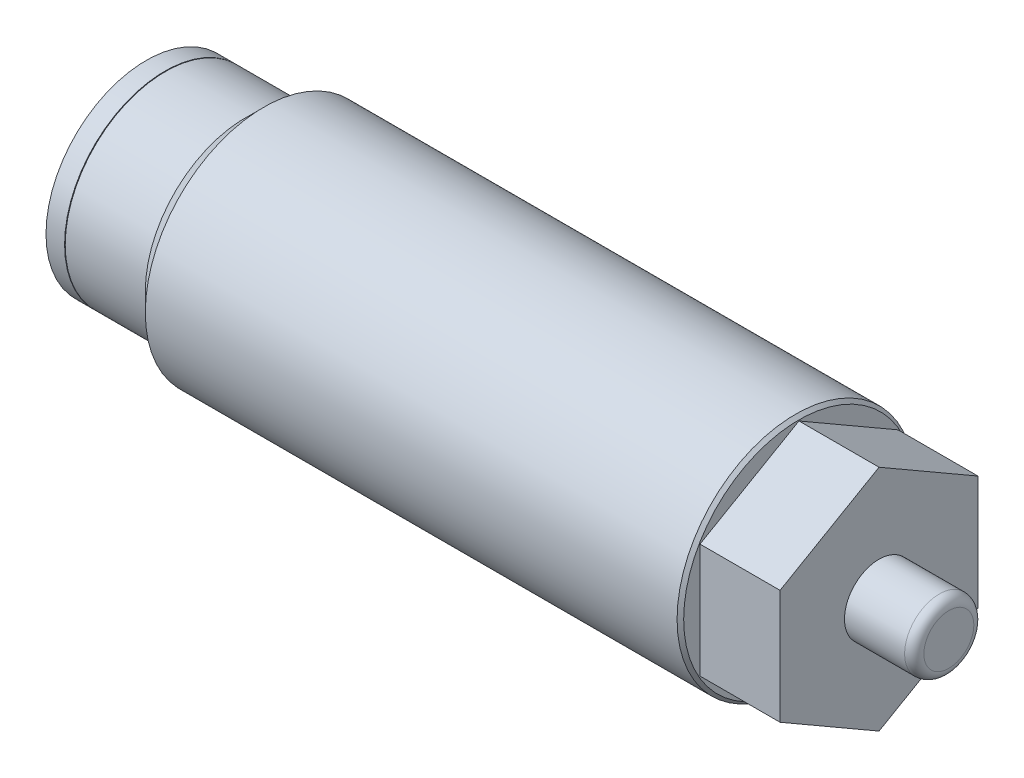
ISO-10303-21;
HEADER;
FILE_DESCRIPTION(('STEP AP214'),'2;1');
FILE_NAME('part.step','',(''),(''),'','','');
FILE_SCHEMA(('AUTOMOTIVE_DESIGN { 1 0 10303 214 1 1 1 1 }'));
ENDSEC;
DATA;
#1=APPLICATION_CONTEXT('core data for automotive mechanical design processes');
#2=APPLICATION_PROTOCOL_DEFINITION('international standard','automotive_design',2000,#1);
#3=PRODUCT_CONTEXT('',#1,'mechanical');
#4=PRODUCT('Part','Part','',(#3));
#5=PRODUCT_RELATED_PRODUCT_CATEGORY('part','',(#4));
#6=PRODUCT_DEFINITION_FORMATION('','',#4);
#7=PRODUCT_DEFINITION_CONTEXT('part definition',#1,'design');
#8=PRODUCT_DEFINITION('design','',#6,#7);
#9=PRODUCT_DEFINITION_SHAPE('','',#8);
#10=(LENGTH_UNIT() NAMED_UNIT(*) SI_UNIT(.MILLI.,.METRE.));
#11=(NAMED_UNIT(*) PLANE_ANGLE_UNIT() SI_UNIT($,.RADIAN.));
#12=(NAMED_UNIT(*) SI_UNIT($,.STERADIAN.) SOLID_ANGLE_UNIT());
#13=UNCERTAINTY_MEASURE_WITH_UNIT(LENGTH_MEASURE(1.E-05),#10,'distance_accuracy_value','');
#14=(GEOMETRIC_REPRESENTATION_CONTEXT(3) GLOBAL_UNCERTAINTY_ASSIGNED_CONTEXT((#13)) GLOBAL_UNIT_ASSIGNED_CONTEXT((#10,
#11,#12)) REPRESENTATION_CONTEXT('',''));
#15=CARTESIAN_POINT('',(0.,0.,0.));
#16=DIRECTION('',(0.,0.,1.));
#17=DIRECTION('',(1.,0.,0.));
#18=AXIS2_PLACEMENT_3D('',#15,#16,#17);
#19=CARTESIAN_POINT('',(28.2956,0.,0.));
#20=DIRECTION('',(1.,0.,0.));
#21=DIRECTION('',(0.,0.,-1.));
#22=AXIS2_PLACEMENT_3D('',#19,#20,#21);
#23=CYLINDRICAL_SURFACE('',#22,1.3716);
#24=CARTESIAN_POINT('',(30.6832,0.,0.));
#25=DIRECTION('',(1.,0.,0.));
#26=DIRECTION('',(0.,0.,-1.));
#27=AXIS2_PLACEMENT_3D('',#24,#25,#26);
#28=CIRCLE('',#27,1.3716);
#29=CARTESIAN_POINT('',(30.6832,0.,-1.3716));
#30=VERTEX_POINT('',#29);
#31=EDGE_CURVE('E11',#30,#30,#28,.F.);
#32=ORIENTED_EDGE('',*,*,#31,.T.);
#33=EDGE_LOOP('',(#32));
#34=FACE_BOUND('',#33,.T.);
#35=CARTESIAN_POINT('',(28.2956,0.,0.));
#36=DIRECTION('',(1.,0.,0.));
#37=DIRECTION('',(0.,0.,-1.));
#38=AXIS2_PLACEMENT_3D('',#35,#36,#37);
#39=CIRCLE('',#38,1.3716);
#40=CARTESIAN_POINT('',(28.2956,0.,-1.3716));
#41=VERTEX_POINT('',#40);
#42=EDGE_CURVE('E52',#41,#41,#39,.T.);
#43=ORIENTED_EDGE('',*,*,#42,.T.);
#44=EDGE_LOOP('',(#43));
#45=FACE_BOUND('',#44,.T.);
#46=ADVANCED_FACE('F41',(#34,#45),#23,.T.);
#47=CARTESIAN_POINT('',(28.2956,1.3716,0.));
#48=DIRECTION('',(-1.,0.,0.));
#49=DIRECTION('',(0.,0.,1.));
#50=AXIS2_PLACEMENT_3D('',#47,#48,#49);
#51=PLANE('',#50);
#52=ORIENTED_EDGE('',*,*,#42,.F.);
#53=EDGE_LOOP('',(#52));
#54=FACE_BOUND('',#53,.T.);
#55=ADVANCED_FACE('F60',(#54),#51,.T.);
#56=CARTESIAN_POINT('',(31.0642,0.,0.));
#57=DIRECTION('',(1.,0.,0.));
#58=DIRECTION('',(0.,0.,-1.));
#59=AXIS2_PLACEMENT_3D('',#56,#57,#58);
#60=PLANE('',#59);
#61=CARTESIAN_POINT('',(31.0642,0.,0.));
#62=DIRECTION('',(1.,0.,0.));
#63=DIRECTION('',(0.,0.,-1.));
#64=AXIS2_PLACEMENT_3D('',#61,#62,#63);
#65=CIRCLE('',#64,0.990599999999999);
#66=CARTESIAN_POINT('',(31.0642,0.,-0.990599999999999));
#67=VERTEX_POINT('',#66);
#68=EDGE_CURVE('E48',#67,#67,#65,.T.);
#69=ORIENTED_EDGE('',*,*,#68,.T.);
#70=EDGE_LOOP('',(#69));
#71=FACE_BOUND('',#70,.T.);
#72=ADVANCED_FACE('F62',(#71),#60,.T.);
#73=CARTESIAN_POINT('',(30.6832,0.,0.));
#74=DIRECTION('',(1.,0.,0.));
#75=DIRECTION('',(0.,0.,-1.));
#76=AXIS2_PLACEMENT_3D('',#73,#74,#75);
#77=TOROIDAL_SURFACE('',#76,0.990599999999999,0.381);
#78=ORIENTED_EDGE('',*,*,#31,.F.);
#79=EDGE_LOOP('',(#78));
#80=FACE_BOUND('',#79,.T.);
#81=ORIENTED_EDGE('',*,*,#68,.F.);
#82=EDGE_LOOP('',(#81));
#83=FACE_BOUND('',#82,.T.);
#84=ADVANCED_FACE('F43',(#80,#83),#77,.T.);
#85=CLOSED_SHELL('',(#46,#55,#72,#84));
#86=MANIFOLD_SOLID_BREP('B2',#85);
#87=CARTESIAN_POINT('',(28.2956,-2.26569566138085,-3.9243));
#88=DIRECTION('',(0.,0.,1.));
#89=DIRECTION('',(1.,0.,0.));
#90=AXIS2_PLACEMENT_3D('',#87,#88,#89);
#91=PLANE('',#90);
#92=DIRECTION('',(0.,1.,0.));
#93=VECTOR('',#92,1.);
#94=CARTESIAN_POINT('',(25.1206,-2.26569566138085,-3.9243));
#95=LINE('',#94,#93);
#96=CARTESIAN_POINT('',(25.1206,-2.26569566138085,-3.9243));
#97=VERTEX_POINT('',#96);
#98=CARTESIAN_POINT('',(25.1206,2.26569566138085,-3.9243));
#99=VERTEX_POINT('',#98);
#100=EDGE_CURVE('E188',#97,#99,#95,.T.);
#101=ORIENTED_EDGE('',*,*,#100,.T.);
#102=DIRECTION('',(-1.,0.,0.));
#103=VECTOR('',#102,1.);
#104=CARTESIAN_POINT('',(28.2956,2.26569566138085,-3.9243));
#105=LINE('',#104,#103);
#106=CARTESIAN_POINT('',(28.2956,2.26569566138085,-3.9243));
#107=VERTEX_POINT('',#106);
#108=EDGE_CURVE('E39',#107,#99,#105,.T.);
#109=ORIENTED_EDGE('',*,*,#108,.F.);
#110=DIRECTION('',(0.,1.,0.));
#111=VECTOR('',#110,1.);
#112=CARTESIAN_POINT('',(28.2956,-2.26569566138085,-3.9243));
#113=LINE('',#112,#111);
#114=CARTESIAN_POINT('',(28.2956,-2.26569566138085,-3.9243));
#115=VERTEX_POINT('',#114);
#116=EDGE_CURVE('E198',#115,#107,#113,.T.);
#117=ORIENTED_EDGE('',*,*,#116,.F.);
#118=DIRECTION('',(-1.,0.,0.));
#119=VECTOR('',#118,1.);
#120=CARTESIAN_POINT('',(28.2956,-2.26569566138085,-3.9243));
#121=LINE('',#120,#119);
#122=EDGE_CURVE('E184',#115,#97,#121,.T.);
#123=ORIENTED_EDGE('',*,*,#122,.T.);
#124=EDGE_LOOP('',(#101,#109,#117,#123));
#125=FACE_BOUND('',#124,.T.);
#126=ADVANCED_FACE('F104',(#125),#91,.F.);
#127=CARTESIAN_POINT('',(28.2956,2.26569566138085,-3.9243));
#128=DIRECTION('',(0.,-0.866025403784439,0.5));
#129=DIRECTION('',(0.,-0.5,-0.866025403784438));
#130=AXIS2_PLACEMENT_3D('',#127,#128,#129);
#131=PLANE('',#130);
#132=DIRECTION('',(0.,0.5,0.866025403784439));
#133=VECTOR('',#132,1.);
#134=CARTESIAN_POINT('',(25.1206,2.26569566138085,-3.9243));
#135=LINE('',#134,#133);
#136=CARTESIAN_POINT('',(25.1206,4.53139132276169,0.));
#137=VERTEX_POINT('',#136);
#138=EDGE_CURVE('E191',#99,#137,#135,.T.);
#139=ORIENTED_EDGE('',*,*,#138,.T.);
#140=DIRECTION('',(-1.,0.,0.));
#141=VECTOR('',#140,1.);
#142=CARTESIAN_POINT('',(28.2956,4.53139132276169,0.));
#143=LINE('',#142,#141);
#144=CARTESIAN_POINT('',(28.2956,4.53139132276169,0.));
#145=VERTEX_POINT('',#144);
#146=EDGE_CURVE('E112',#145,#137,#143,.T.);
#147=ORIENTED_EDGE('',*,*,#146,.F.);
#148=DIRECTION('',(0.,0.5,0.866025403784439));
#149=VECTOR('',#148,1.);
#150=CARTESIAN_POINT('',(28.2956,2.26569566138085,-3.9243));
#151=LINE('',#150,#149);
#152=EDGE_CURVE('E157',#107,#145,#151,.T.);
#153=ORIENTED_EDGE('',*,*,#152,.F.);
#154=ORIENTED_EDGE('',*,*,#108,.T.);
#155=EDGE_LOOP('',(#139,#147,#153,#154));
#156=FACE_BOUND('',#155,.T.);
#157=ADVANCED_FACE('F222',(#156),#131,.F.);
#158=CARTESIAN_POINT('',(28.2956,4.53139132276169,0.));
#159=DIRECTION('',(0.,-0.866025403784439,-0.5));
#160=DIRECTION('',(0.,0.5,-0.866025403784439));
#161=AXIS2_PLACEMENT_3D('',#158,#159,#160);
#162=PLANE('',#161);
#163=DIRECTION('',(0.,-0.5,0.866025403784439));
#164=VECTOR('',#163,1.);
#165=CARTESIAN_POINT('',(25.1206,4.53139132276169,0.));
#166=LINE('',#165,#164);
#167=CARTESIAN_POINT('',(25.1206,2.26569566138085,3.9243));
#168=VERTEX_POINT('',#167);
#169=EDGE_CURVE('E193',#137,#168,#166,.T.);
#170=ORIENTED_EDGE('',*,*,#169,.T.);
#171=DIRECTION('',(-1.,0.,0.));
#172=VECTOR('',#171,1.);
#173=CARTESIAN_POINT('',(28.2956,2.26569566138085,3.9243));
#174=LINE('',#173,#172);
#175=CARTESIAN_POINT('',(28.2956,2.26569566138085,3.9243));
#176=VERTEX_POINT('',#175);
#177=EDGE_CURVE('E179',#176,#168,#174,.T.);
#178=ORIENTED_EDGE('',*,*,#177,.F.);
#179=DIRECTION('',(0.,-0.5,0.866025403784439));
#180=VECTOR('',#179,1.);
#181=CARTESIAN_POINT('',(28.2956,4.53139132276169,0.));
#182=LINE('',#181,#180);
#183=EDGE_CURVE('E170',#145,#176,#182,.T.);
#184=ORIENTED_EDGE('',*,*,#183,.F.);
#185=ORIENTED_EDGE('',*,*,#146,.T.);
#186=EDGE_LOOP('',(#170,#178,#184,#185));
#187=FACE_BOUND('',#186,.T.);
#188=ADVANCED_FACE('F204',(#187),#162,.F.);
#189=CARTESIAN_POINT('',(28.2956,2.26569566138085,3.9243));
#190=DIRECTION('',(0.,0.,-1.));
#191=DIRECTION('',(-1.,0.,0.));
#192=AXIS2_PLACEMENT_3D('',#189,#190,#191);
#193=PLANE('',#192);
#194=DIRECTION('',(0.,-1.,0.));
#195=VECTOR('',#194,1.);
#196=CARTESIAN_POINT('',(25.1206,2.26569566138085,3.9243));
#197=LINE('',#196,#195);
#198=CARTESIAN_POINT('',(25.1206,-2.26569566138085,3.9243));
#199=VERTEX_POINT('',#198);
#200=EDGE_CURVE('E178',#168,#199,#197,.T.);
#201=ORIENTED_EDGE('',*,*,#200,.T.);
#202=DIRECTION('',(-1.,0.,0.));
#203=VECTOR('',#202,1.);
#204=CARTESIAN_POINT('',(28.2956,-2.26569566138085,3.9243));
#205=LINE('',#204,#203);
#206=CARTESIAN_POINT('',(28.2956,-2.26569566138085,3.9243));
#207=VERTEX_POINT('',#206);
#208=EDGE_CURVE('E175',#207,#199,#205,.T.);
#209=ORIENTED_EDGE('',*,*,#208,.F.);
#210=DIRECTION('',(0.,-1.,0.));
#211=VECTOR('',#210,1.);
#212=CARTESIAN_POINT('',(28.2956,2.26569566138085,3.9243));
#213=LINE('',#212,#211);
#214=EDGE_CURVE('E164',#176,#207,#213,.T.);
#215=ORIENTED_EDGE('',*,*,#214,.F.);
#216=ORIENTED_EDGE('',*,*,#177,.T.);
#217=EDGE_LOOP('',(#201,#209,#215,#216));
#218=FACE_BOUND('',#217,.T.);
#219=ADVANCED_FACE('F176',(#218),#193,.F.);
#220=CARTESIAN_POINT('',(28.2956,-2.26569566138085,3.9243));
#221=DIRECTION('',(0.,0.866025403784439,-0.5));
#222=DIRECTION('',(0.,0.5,0.866025403784439));
#223=AXIS2_PLACEMENT_3D('',#220,#221,#222);
#224=PLANE('',#223);
#225=DIRECTION('',(0.,-0.5,-0.866025403784439));
#226=VECTOR('',#225,1.);
#227=CARTESIAN_POINT('',(25.1206,-2.26569566138085,3.9243));
#228=LINE('',#227,#226);
#229=CARTESIAN_POINT('',(25.1206,-4.5313913227617,0.));
#230=VERTEX_POINT('',#229);
#231=EDGE_CURVE('E143',#199,#230,#228,.T.);
#232=ORIENTED_EDGE('',*,*,#231,.T.);
#233=DIRECTION('',(-1.,0.,0.));
#234=VECTOR('',#233,1.);
#235=CARTESIAN_POINT('',(28.2956,-4.5313913227617,0.));
#236=LINE('',#235,#234);
#237=CARTESIAN_POINT('',(28.2956,-4.5313913227617,0.));
#238=VERTEX_POINT('',#237);
#239=EDGE_CURVE('E180',#238,#230,#236,.T.);
#240=ORIENTED_EDGE('',*,*,#239,.F.);
#241=DIRECTION('',(0.,-0.5,-0.866025403784439));
#242=VECTOR('',#241,1.);
#243=CARTESIAN_POINT('',(28.2956,-2.26569566138085,3.9243));
#244=LINE('',#243,#242);
#245=EDGE_CURVE('E168',#207,#238,#244,.T.);
#246=ORIENTED_EDGE('',*,*,#245,.F.);
#247=ORIENTED_EDGE('',*,*,#208,.T.);
#248=EDGE_LOOP('',(#232,#240,#246,#247));
#249=FACE_BOUND('',#248,.T.);
#250=ADVANCED_FACE('F182',(#249),#224,.F.);
#251=CARTESIAN_POINT('',(28.2956,-4.5313913227617,0.));
#252=DIRECTION('',(0.,0.866025403784439,0.5));
#253=DIRECTION('',(0.,-0.5,0.866025403784439));
#254=AXIS2_PLACEMENT_3D('',#251,#252,#253);
#255=PLANE('',#254);
#256=DIRECTION('',(0.,0.5,-0.866025403784439));
#257=VECTOR('',#256,1.);
#258=CARTESIAN_POINT('',(25.1206,-4.5313913227617,0.));
#259=LINE('',#258,#257);
#260=EDGE_CURVE('E149',#230,#97,#259,.T.);
#261=ORIENTED_EDGE('',*,*,#260,.T.);
#262=ORIENTED_EDGE('',*,*,#122,.F.);
#263=DIRECTION('',(0.,0.5,-0.866025403784439));
#264=VECTOR('',#263,1.);
#265=CARTESIAN_POINT('',(28.2956,-4.5313913227617,0.));
#266=LINE('',#265,#264);
#267=EDGE_CURVE('E120',#238,#115,#266,.T.);
#268=ORIENTED_EDGE('',*,*,#267,.F.);
#269=ORIENTED_EDGE('',*,*,#239,.T.);
#270=EDGE_LOOP('',(#261,#262,#268,#269));
#271=FACE_BOUND('',#270,.T.);
#272=ADVANCED_FACE('F211',(#271),#255,.F.);
#273=CARTESIAN_POINT('',(28.2956,6.79708698414254,-3.9243));
#274=DIRECTION('',(1.,0.,0.));
#275=DIRECTION('',(0.,0.,-1.));
#276=AXIS2_PLACEMENT_3D('',#273,#274,#275);
#277=PLANE('',#276);
#278=ORIENTED_EDGE('',*,*,#116,.T.);
#279=ORIENTED_EDGE('',*,*,#152,.T.);
#280=ORIENTED_EDGE('',*,*,#183,.T.);
#281=ORIENTED_EDGE('',*,*,#214,.T.);
#282=ORIENTED_EDGE('',*,*,#245,.T.);
#283=ORIENTED_EDGE('',*,*,#267,.T.);
#284=EDGE_LOOP('',(#278,#279,#280,#281,#282,#283));
#285=FACE_BOUND('',#284,.T.);
#286=ADVANCED_FACE('F166',(#285),#277,.T.);
#287=CARTESIAN_POINT('',(25.1206,6.79708698414254,-3.9243));
#288=DIRECTION('',(1.,0.,0.));
#289=DIRECTION('',(0.,0.,-1.));
#290=AXIS2_PLACEMENT_3D('',#287,#288,#289);
#291=PLANE('',#290);
#292=ORIENTED_EDGE('',*,*,#100,.F.);
#293=ORIENTED_EDGE('',*,*,#260,.F.);
#294=ORIENTED_EDGE('',*,*,#231,.F.);
#295=ORIENTED_EDGE('',*,*,#200,.F.);
#296=ORIENTED_EDGE('',*,*,#169,.F.);
#297=ORIENTED_EDGE('',*,*,#138,.F.);
#298=EDGE_LOOP('',(#292,#293,#294,#295,#296,#297));
#299=FACE_BOUND('',#298,.T.);
#300=ADVANCED_FACE('F207',(#299),#291,.F.);
#301=CLOSED_SHELL('',(#126,#157,#188,#219,#250,#272,#286,#300));
#302=MANIFOLD_SOLID_BREP('B6',#301);
#303=CARTESIAN_POINT('',(30.6025425410263,0.,0.));
#304=DIRECTION('',(-1.,0.,0.));
#305=DIRECTION('',(0.,0.,1.));
#306=AXIS2_PLACEMENT_3D('',#303,#304,#305);
#307=CYLINDRICAL_SURFACE('',#306,4.70281);
#308=CARTESIAN_POINT('',(24.98979,0.,0.));
#309=DIRECTION('',(1.,0.,0.));
#310=DIRECTION('',(0.,0.,-1.));
#311=AXIS2_PLACEMENT_3D('',#308,#309,#310);
#312=CIRCLE('',#311,4.70281);
#313=CARTESIAN_POINT('',(24.98979,0.,-4.70281));
#314=VERTEX_POINT('',#313);
#315=EDGE_CURVE('E293',#314,#314,#312,.F.);
#316=ORIENTED_EDGE('',*,*,#315,.T.);
#317=EDGE_LOOP('',(#316));
#318=FACE_BOUND('',#317,.T.);
#319=CARTESIAN_POINT('',(3.90271,0.,0.));
#320=DIRECTION('',(-1.,0.,0.));
#321=DIRECTION('',(0.,0.,1.));
#322=AXIS2_PLACEMENT_3D('',#319,#320,#321);
#323=CIRCLE('',#322,4.70281);
#324=CARTESIAN_POINT('',(3.90271,0.,4.70281));
#325=VERTEX_POINT('',#324);
#326=EDGE_CURVE('E306',#325,#325,#323,.T.);
#327=ORIENTED_EDGE('',*,*,#326,.F.);
#328=EDGE_LOOP('',(#327));
#329=FACE_BOUND('',#328,.T.);
#330=ADVANCED_FACE('F286',(#318,#329),#307,.T.);
#331=CARTESIAN_POINT('',(25.1206,4.70281,0.));
#332=DIRECTION('',(1.,0.,0.));
#333=DIRECTION('',(0.,0.,-1.));
#334=AXIS2_PLACEMENT_3D('',#331,#332,#333);
#335=PLANE('',#334);
#336=CARTESIAN_POINT('',(25.1206,0.,0.));
#337=DIRECTION('',(1.,0.,0.));
#338=DIRECTION('',(0.,0.,-1.));
#339=AXIS2_PLACEMENT_3D('',#336,#337,#338);
#340=CIRCLE('',#339,4.572);
#341=CARTESIAN_POINT('',(25.1206,0.,-4.572));
#342=VERTEX_POINT('',#341);
#343=EDGE_CURVE('E103',#342,#342,#340,.T.);
#344=ORIENTED_EDGE('',*,*,#343,.T.);
#345=EDGE_LOOP('',(#344));
#346=FACE_BOUND('',#345,.T.);
#347=ADVANCED_FACE('F322',(#346),#335,.T.);
#348=CARTESIAN_POINT('',(0.,0.,0.));
#349=DIRECTION('',(-1.,0.,0.));
#350=DIRECTION('',(0.,0.,1.));
#351=AXIS2_PLACEMENT_3D('',#348,#349,#350);
#352=PLANE('',#351);
#353=CARTESIAN_POINT('',(0.,0.,0.));
#354=DIRECTION('',(-1.,0.,0.));
#355=DIRECTION('',(0.,0.,1.));
#356=AXIS2_PLACEMENT_3D('',#353,#354,#355);
#357=CIRCLE('',#356,2.48920000000001);
#358=CARTESIAN_POINT('',(0.,0.,2.48920000000001));
#359=VERTEX_POINT('',#358);
#360=EDGE_CURVE('E312',#359,#359,#357,.T.);
#361=ORIENTED_EDGE('',*,*,#360,.F.);
#362=EDGE_LOOP('',(#361));
#363=FACE_BOUND('',#362,.T.);
#364=CARTESIAN_POINT('',(0.,0.,0.));
#365=DIRECTION('',(-1.,0.,0.));
#366=DIRECTION('',(0.,0.,1.));
#367=AXIS2_PLACEMENT_3D('',#364,#365,#366);
#368=CIRCLE('',#367,3.9751);
#369=CARTESIAN_POINT('',(0.,0.,3.9751));
#370=VERTEX_POINT('',#369);
#371=EDGE_CURVE('E297',#370,#370,#368,.T.);
#372=ORIENTED_EDGE('',*,*,#371,.T.);
#373=EDGE_LOOP('',(#372));
#374=FACE_BOUND('',#373,.T.);
#375=ADVANCED_FACE('F318',(#363,#374),#352,.T.);
#376=CARTESIAN_POINT('',(30.6025425410263,0.,0.));
#377=DIRECTION('',(-1.,0.,0.));
#378=DIRECTION('',(0.,0.,1.));
#379=AXIS2_PLACEMENT_3D('',#376,#377,#378);
#380=CYLINDRICAL_SURFACE('',#379,3.97509999999999);
#381=CARTESIAN_POINT('',(3.17499999999998,0.,0.));
#382=DIRECTION('',(-1.,0.,0.));
#383=DIRECTION('',(0.,0.,1.));
#384=AXIS2_PLACEMENT_3D('',#381,#382,#383);
#385=CIRCLE('',#384,3.97509999999998);
#386=CARTESIAN_POINT('',(3.17499999999998,0.,3.97509999999998));
#387=VERTEX_POINT('',#386);
#388=EDGE_CURVE('E301',#387,#387,#385,.T.);
#389=ORIENTED_EDGE('',*,*,#388,.T.);
#390=EDGE_LOOP('',(#389));
#391=FACE_BOUND('',#390,.T.);
#392=ORIENTED_EDGE('',*,*,#371,.F.);
#393=EDGE_LOOP('',(#392));
#394=FACE_BOUND('',#393,.T.);
#395=ADVANCED_FACE('F321',(#391,#394),#380,.T.);
#396=CARTESIAN_POINT('',(3.17499999999998,0.,0.));
#397=DIRECTION('',(1.,0.,0.));
#398=DIRECTION('',(0.,0.,-1.));
#399=AXIS2_PLACEMENT_3D('',#396,#397,#398);
#400=CONICAL_SURFACE('',#399,3.97509999999998,0.785398163397451);
#401=ORIENTED_EDGE('',*,*,#326,.T.);
#402=EDGE_LOOP('',(#401));
#403=FACE_BOUND('',#402,.T.);
#404=ORIENTED_EDGE('',*,*,#388,.F.);
#405=EDGE_LOOP('',(#404));
#406=FACE_BOUND('',#405,.T.);
#407=ADVANCED_FACE('F327',(#403,#406),#400,.T.);
#408=CARTESIAN_POINT('',(0.254000000000004,0.,0.));
#409=DIRECTION('',(1.,0.,0.));
#410=DIRECTION('',(0.,0.,-1.));
#411=AXIS2_PLACEMENT_3D('',#408,#409,#410);
#412=PLANE('',#411);
#413=CARTESIAN_POINT('',(0.254000000000004,0.,0.));
#414=DIRECTION('',(-1.,0.,0.));
#415=DIRECTION('',(0.,0.,1.));
#416=AXIS2_PLACEMENT_3D('',#413,#414,#415);
#417=CIRCLE('',#416,2.48920000000001);
#418=CARTESIAN_POINT('',(0.254000000000004,0.,2.48920000000001));
#419=VERTEX_POINT('',#418);
#420=EDGE_CURVE('E309',#419,#419,#417,.T.);
#421=ORIENTED_EDGE('',*,*,#420,.T.);
#422=EDGE_LOOP('',(#421));
#423=FACE_BOUND('',#422,.T.);
#424=ADVANCED_FACE('F333',(#423),#412,.F.);
#425=CARTESIAN_POINT('',(0.,0.,0.));
#426=DIRECTION('',(-1.,0.,0.));
#427=DIRECTION('',(0.,0.,1.));
#428=AXIS2_PLACEMENT_3D('',#425,#426,#427);
#429=CYLINDRICAL_SURFACE('',#428,2.48920000000001);
#430=ORIENTED_EDGE('',*,*,#420,.F.);
#431=EDGE_LOOP('',(#430));
#432=FACE_BOUND('',#431,.T.);
#433=ORIENTED_EDGE('',*,*,#360,.T.);
#434=EDGE_LOOP('',(#433));
#435=FACE_BOUND('',#434,.T.);
#436=ADVANCED_FACE('F316',(#432,#435),#429,.F.);
#437=CARTESIAN_POINT('',(24.98979,0.,0.));
#438=DIRECTION('',(-1.,0.,0.));
#439=DIRECTION('',(0.,0.,1.));
#440=AXIS2_PLACEMENT_3D('',#437,#438,#439);
#441=CONICAL_SURFACE('',#440,4.70281,0.785398163397448);
#442=ORIENTED_EDGE('',*,*,#343,.F.);
#443=EDGE_LOOP('',(#442));
#444=FACE_BOUND('',#443,.T.);
#445=ORIENTED_EDGE('',*,*,#315,.F.);
#446=EDGE_LOOP('',(#445));
#447=FACE_BOUND('',#446,.T.);
#448=ADVANCED_FACE('F288',(#444,#447),#441,.T.);
#449=CLOSED_SHELL('',(#330,#347,#375,#395,#407,#424,#436,#448));
#450=MANIFOLD_SOLID_BREP('B33',#449);
#451=CARTESIAN_POINT('',(-0.0254,1.905,0.));
#452=DIRECTION('',(1.,0.,0.));
#453=DIRECTION('',(0.,0.,-1.));
#454=AXIS2_PLACEMENT_3D('',#451,#452,#453);
#455=PLANE('',#454);
#456=CARTESIAN_POINT('',(-0.0254,0.,0.));
#457=DIRECTION('',(1.,0.,0.));
#458=DIRECTION('',(0.,0.,-1.));
#459=AXIS2_PLACEMENT_3D('',#456,#457,#458);
#460=CIRCLE('',#459,3.9751);
#461=CARTESIAN_POINT('',(-0.0254,0.,-3.9751));
#462=VERTEX_POINT('',#461);
#463=EDGE_CURVE('E285',#462,#462,#460,.T.);
#464=ORIENTED_EDGE('',*,*,#463,.T.);
#465=EDGE_LOOP('',(#464));
#466=FACE_BOUND('',#465,.T.);
#467=CARTESIAN_POINT('',(-0.0254,0.,0.));
#468=DIRECTION('',(1.,0.,0.));
#469=DIRECTION('',(0.,0.,-1.));
#470=AXIS2_PLACEMENT_3D('',#467,#468,#469);
#471=CIRCLE('',#470,1.905);
#472=CARTESIAN_POINT('',(-0.0254,0.,-1.905));
#473=VERTEX_POINT('',#472);
#474=EDGE_CURVE('E415',#473,#473,#471,.T.);
#475=ORIENTED_EDGE('',*,*,#474,.F.);
#476=EDGE_LOOP('',(#475));
#477=FACE_BOUND('',#476,.T.);
#478=ADVANCED_FACE('F401',(#466,#477),#455,.T.);
#479=CARTESIAN_POINT('',(-0.762,0.,0.));
#480=DIRECTION('',(1.,0.,0.));
#481=DIRECTION('',(0.,0.,-1.));
#482=AXIS2_PLACEMENT_3D('',#479,#480,#481);
#483=CYLINDRICAL_SURFACE('',#482,3.9751);
#484=CARTESIAN_POINT('',(-0.762,0.,0.));
#485=DIRECTION('',(1.,0.,0.));
#486=DIRECTION('',(0.,0.,-1.));
#487=AXIS2_PLACEMENT_3D('',#484,#485,#486);
#488=CIRCLE('',#487,3.9751);
#489=CARTESIAN_POINT('',(-0.762,0.,-3.9751));
#490=VERTEX_POINT('',#489);
#491=EDGE_CURVE('E407',#490,#490,#488,.T.);
#492=ORIENTED_EDGE('',*,*,#491,.T.);
#493=EDGE_LOOP('',(#492));
#494=FACE_BOUND('',#493,.T.);
#495=ORIENTED_EDGE('',*,*,#463,.F.);
#496=EDGE_LOOP('',(#495));
#497=FACE_BOUND('',#496,.T.);
#498=ADVANCED_FACE('F425',(#494,#497),#483,.T.);
#499=CARTESIAN_POINT('',(-0.762,3.9751,0.));
#500=DIRECTION('',(-1.,0.,0.));
#501=DIRECTION('',(0.,0.,1.));
#502=AXIS2_PLACEMENT_3D('',#499,#500,#501);
#503=PLANE('',#502);
#504=CARTESIAN_POINT('',(-0.762,0.,0.));
#505=DIRECTION('',(1.,0.,0.));
#506=DIRECTION('',(0.,0.,-1.));
#507=AXIS2_PLACEMENT_3D('',#504,#505,#506);
#508=CIRCLE('',#507,1.905);
#509=CARTESIAN_POINT('',(-0.762,0.,-1.905));
#510=VERTEX_POINT('',#509);
#511=EDGE_CURVE('E411',#510,#510,#508,.T.);
#512=ORIENTED_EDGE('',*,*,#511,.T.);
#513=EDGE_LOOP('',(#512));
#514=FACE_BOUND('',#513,.T.);
#515=ORIENTED_EDGE('',*,*,#491,.F.);
#516=EDGE_LOOP('',(#515));
#517=FACE_BOUND('',#516,.T.);
#518=ADVANCED_FACE('F429',(#514,#517),#503,.T.);
#519=CARTESIAN_POINT('',(-0.762,0.,0.));
#520=DIRECTION('',(1.,0.,0.));
#521=DIRECTION('',(0.,0.,-1.));
#522=AXIS2_PLACEMENT_3D('',#519,#520,#521);
#523=CYLINDRICAL_SURFACE('',#522,1.905);
#524=ORIENTED_EDGE('',*,*,#474,.T.);
#525=EDGE_LOOP('',(#524));
#526=FACE_BOUND('',#525,.T.);
#527=ORIENTED_EDGE('',*,*,#511,.F.);
#528=EDGE_LOOP('',(#527));
#529=FACE_BOUND('',#528,.T.);
#530=ADVANCED_FACE('F421',(#526,#529),#523,.F.);
#531=CLOSED_SHELL('',(#478,#498,#518,#530));
#532=MANIFOLD_SOLID_BREP('B98',#531);
#533=ADVANCED_BREP_SHAPE_REPRESENTATION('',(#18,#86,#302,#450,#532),#14);
#534=SHAPE_DEFINITION_REPRESENTATION(#9,#533);
ENDSEC;
END-ISO-10303-21;
